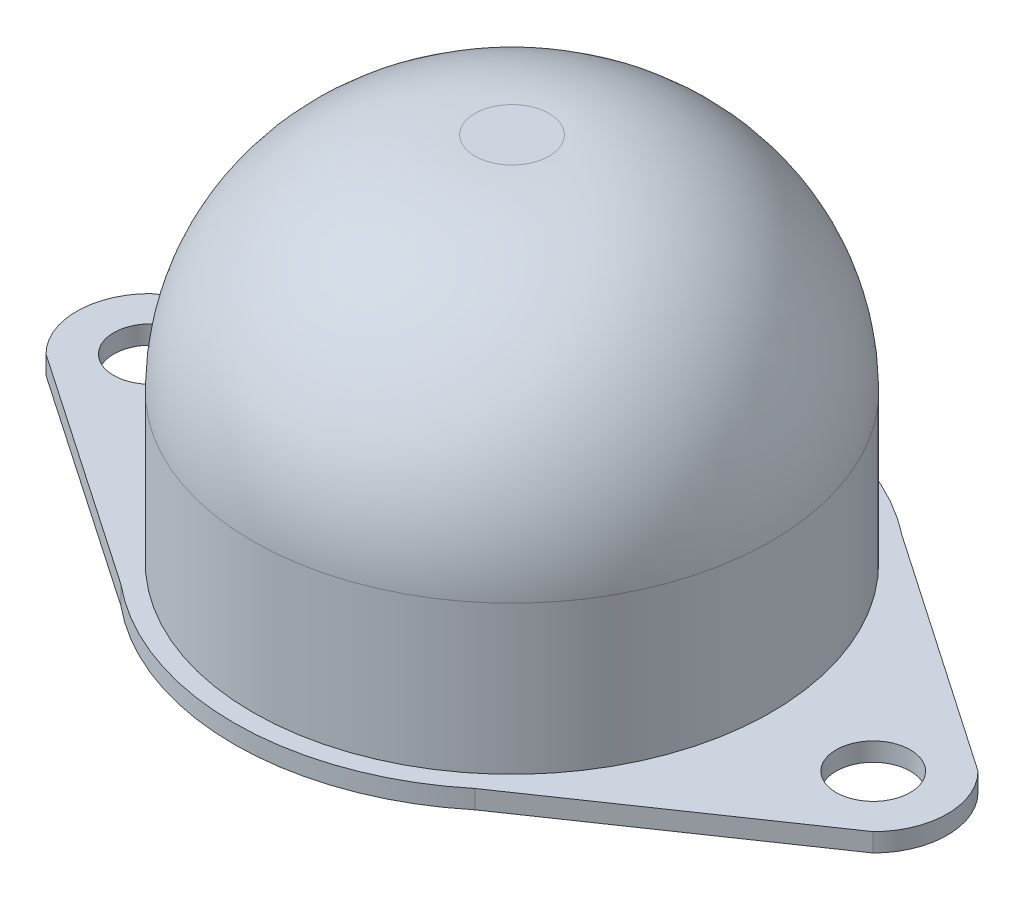
ISO-10303-21;
HEADER;
FILE_DESCRIPTION(('STEP AP214'),'2;1');
FILE_NAME('part.step','',(''),(''),'','','');
FILE_SCHEMA(('AUTOMOTIVE_DESIGN { 1 0 10303 214 1 1 1 1 }'));
ENDSEC;
DATA;
#1=APPLICATION_CONTEXT('core data for automotive mechanical design processes');
#2=APPLICATION_PROTOCOL_DEFINITION('international standard','automotive_design',2000,#1);
#3=PRODUCT_CONTEXT('',#1,'mechanical');
#4=PRODUCT('Part','Part','',(#3));
#5=PRODUCT_RELATED_PRODUCT_CATEGORY('part','',(#4));
#6=PRODUCT_DEFINITION_FORMATION('','',#4);
#7=PRODUCT_DEFINITION_CONTEXT('part definition',#1,'design');
#8=PRODUCT_DEFINITION('design','',#6,#7);
#9=PRODUCT_DEFINITION_SHAPE('','',#8);
#10=(LENGTH_UNIT() NAMED_UNIT(*) SI_UNIT(.MILLI.,.METRE.));
#11=(NAMED_UNIT(*) PLANE_ANGLE_UNIT() SI_UNIT($,.RADIAN.));
#12=(NAMED_UNIT(*) SI_UNIT($,.STERADIAN.) SOLID_ANGLE_UNIT());
#13=UNCERTAINTY_MEASURE_WITH_UNIT(LENGTH_MEASURE(1.E-05),#10,'distance_accuracy_value','');
#14=(GEOMETRIC_REPRESENTATION_CONTEXT(3) GLOBAL_UNCERTAINTY_ASSIGNED_CONTEXT((#13)) GLOBAL_UNIT_ASSIGNED_CONTEXT((#10,
#11,#12)) REPRESENTATION_CONTEXT('',''));
#15=CARTESIAN_POINT('',(0.,0.,0.));
#16=DIRECTION('',(0.,0.,1.));
#17=DIRECTION('',(1.,0.,0.));
#18=AXIS2_PLACEMENT_3D('',#15,#16,#17);
#19=CARTESIAN_POINT('',(0.,-1.,0.));
#20=DIRECTION('',(0.,1.,0.));
#21=DIRECTION('',(0.,0.,1.));
#22=AXIS2_PLACEMENT_3D('',#19,#20,#21);
#23=CYLINDRICAL_SURFACE('',#22,15.);
#24=DIRECTION('',(0.,1.,0.));
#25=VECTOR('',#24,1.);
#26=CARTESIAN_POINT('',(9.55682376628912,-1.,11.5614497144645));
#27=LINE('',#26,#25);
#28=CARTESIAN_POINT('',(9.55682376628912,-1.,11.5614497144645));
#29=VERTEX_POINT('',#28);
#30=CARTESIAN_POINT('',(9.55682376628912,0.,11.5614497144645));
#31=VERTEX_POINT('',#30);
#32=EDGE_CURVE('E141',#29,#31,#27,.T.);
#33=ORIENTED_EDGE('',*,*,#32,.T.);
#34=CARTESIAN_POINT('',(0.,0.,0.));
#35=DIRECTION('',(0.,-1.,0.));
#36=DIRECTION('',(0.,0.,-1.));
#37=AXIS2_PLACEMENT_3D('',#34,#35,#36);
#38=CIRCLE('',#37,15.);
#39=CARTESIAN_POINT('',(-9.55682376628912,0.,11.5614497144645));
#40=VERTEX_POINT('',#39);
#41=EDGE_CURVE('E170',#31,#40,#38,.T.);
#42=ORIENTED_EDGE('',*,*,#41,.T.);
#43=DIRECTION('',(0.,1.,0.));
#44=VECTOR('',#43,1.);
#45=CARTESIAN_POINT('',(-9.55682376628912,-1.,11.5614497144645));
#46=LINE('',#45,#44);
#47=CARTESIAN_POINT('',(-9.55682376628912,-1.,11.5614497144645));
#48=VERTEX_POINT('',#47);
#49=EDGE_CURVE('E174',#48,#40,#46,.T.);
#50=ORIENTED_EDGE('',*,*,#49,.F.);
#51=CARTESIAN_POINT('',(0.,-1.,0.));
#52=DIRECTION('',(0.,-1.,0.));
#53=DIRECTION('',(0.,0.,-1.));
#54=AXIS2_PLACEMENT_3D('',#51,#52,#53);
#55=CIRCLE('',#54,15.);
#56=EDGE_CURVE('E49',#29,#48,#55,.T.);
#57=ORIENTED_EDGE('',*,*,#56,.F.);
#58=EDGE_LOOP('',(#33,#42,#50,#57));
#59=FACE_BOUND('',#58,.T.);
#60=ADVANCED_FACE('F34',(#59),#23,.T.);
#61=CARTESIAN_POINT('',(-9.30029768144452,0.,-11.7687919106643));
#62=VERTEX_POINT('',#61);
#63=CARTESIAN_POINT('',(9.30029768144447,0.,-11.7687919106643));
#64=VERTEX_POINT('',#63);
#65=EDGE_CURVE('E180',#62,#64,#38,.T.);
#66=ORIENTED_EDGE('',*,*,#65,.T.);
#67=DIRECTION('',(0.,1.,0.));
#68=VECTOR('',#67,1.);
#69=CARTESIAN_POINT('',(9.30029768144452,-1.,-11.7687919106643));
#70=LINE('',#69,#68);
#71=CARTESIAN_POINT('',(9.30029768144447,-1.,-11.7687919106643));
#72=VERTEX_POINT('',#71);
#73=EDGE_CURVE('E57',#72,#64,#70,.T.);
#74=ORIENTED_EDGE('',*,*,#73,.F.);
#75=CARTESIAN_POINT('',(-9.30029768144451,-1.,-11.7687919106643));
#76=VERTEX_POINT('',#75);
#77=EDGE_CURVE('E124',#76,#72,#55,.T.);
#78=ORIENTED_EDGE('',*,*,#77,.F.);
#79=DIRECTION('',(0.,1.,0.));
#80=VECTOR('',#79,1.);
#81=CARTESIAN_POINT('',(-9.30029768144452,-1.,-11.7687919106643));
#82=LINE('',#81,#80);
#83=EDGE_CURVE('E171',#76,#62,#82,.T.);
#84=ORIENTED_EDGE('',*,*,#83,.T.);
#85=EDGE_LOOP('',(#66,#74,#78,#84));
#86=FACE_BOUND('',#85,.T.);
#87=ADVANCED_FACE('F200',(#86),#23,.T.);
#88=CARTESIAN_POINT('',(0.,20.,0.));
#89=DIRECTION('',(0.,-1.,0.));
#90=DIRECTION('',(0.,0.,-1.));
#91=AXIS2_PLACEMENT_3D('',#88,#89,#90);
#92=CYLINDRICAL_SURFACE('',#91,14.);
#93=CARTESIAN_POINT('',(0.,8.,0.));
#94=DIRECTION('',(0.,1.,0.));
#95=DIRECTION('',(0.,0.,1.));
#96=AXIS2_PLACEMENT_3D('',#93,#94,#95);
#97=CIRCLE('',#96,14.);
#98=CARTESIAN_POINT('',(0.,8.,14.));
#99=VERTEX_POINT('',#98);
#100=EDGE_CURVE('E11',#99,#99,#97,.F.);
#101=ORIENTED_EDGE('',*,*,#100,.T.);
#102=EDGE_LOOP('',(#101));
#103=FACE_BOUND('',#102,.T.);
#104=CARTESIAN_POINT('',(0.,0.,0.));
#105=DIRECTION('',(0.,1.,0.));
#106=DIRECTION('',(0.,0.,1.));
#107=AXIS2_PLACEMENT_3D('',#104,#105,#106);
#108=CIRCLE('',#107,14.);
#109=CARTESIAN_POINT('',(0.,0.,14.));
#110=VERTEX_POINT('',#109);
#111=EDGE_CURVE('E179',#110,#110,#108,.T.);
#112=ORIENTED_EDGE('',*,*,#111,.T.);
#113=EDGE_LOOP('',(#112));
#114=FACE_BOUND('',#113,.T.);
#115=ADVANCED_FACE('F196',(#103,#114),#92,.T.);
#116=CARTESIAN_POINT('',(0.,20.,0.));
#117=DIRECTION('',(0.,1.,0.));
#118=DIRECTION('',(0.,0.,1.));
#119=AXIS2_PLACEMENT_3D('',#116,#117,#118);
#120=PLANE('',#119);
#121=CARTESIAN_POINT('',(0.,20.,0.));
#122=DIRECTION('',(0.,1.,0.));
#123=DIRECTION('',(0.,0.,1.));
#124=AXIS2_PLACEMENT_3D('',#121,#122,#123);
#125=CIRCLE('',#124,2.);
#126=CARTESIAN_POINT('',(0.,20.,2.));
#127=VERTEX_POINT('',#126);
#128=EDGE_CURVE('E42',#127,#127,#125,.T.);
#129=ORIENTED_EDGE('',*,*,#128,.T.);
#130=EDGE_LOOP('',(#129));
#131=FACE_BOUND('',#130,.T.);
#132=ADVANCED_FACE('F186',(#131),#120,.T.);
#133=CARTESIAN_POINT('',(0.,8.,0.));
#134=DIRECTION('',(0.,1.,0.));
#135=DIRECTION('',(0.,0.,1.));
#136=AXIS2_PLACEMENT_3D('',#133,#134,#135);
#137=DEGENERATE_TOROIDAL_SURFACE('',#136,2.,12.,.T.);
#138=ORIENTED_EDGE('',*,*,#100,.F.);
#139=EDGE_LOOP('',(#138));
#140=FACE_BOUND('',#139,.T.);
#141=ORIENTED_EDGE('',*,*,#128,.F.);
#142=EDGE_LOOP('',(#141));
#143=FACE_BOUND('',#142,.T.);
#144=ADVANCED_FACE('F36',(#140,#143),#137,.T.);
#145=CARTESIAN_POINT('',(0.,-1.,0.));
#146=DIRECTION('',(0.,-1.,0.));
#147=DIRECTION('',(0.,0.,-1.));
#148=AXIS2_PLACEMENT_3D('',#145,#146,#147);
#149=PLANE('',#148);
#150=ORIENTED_EDGE('',*,*,#77,.T.);
#151=DIRECTION('',(-0.824528362654497,0.,-0.56582062456073));
#152=VECTOR('',#151,1.);
#153=CARTESIAN_POINT('',(8.46807314609988,-1.,-12.3398939220584));
#154=LINE('',#153,#152);
#155=CARTESIAN_POINT('',(22.3284271247462,-1.,-2.82842712474619));
#156=VERTEX_POINT('',#155);
#157=EDGE_CURVE('E104',#156,#72,#154,.T.);
#158=ORIENTED_EDGE('',*,*,#157,.F.);
#159=CARTESIAN_POINT('',(19.5,-1.,0.));
#160=DIRECTION('',(0.,1.,0.));
#161=DIRECTION('',(0.,0.,1.));
#162=AXIS2_PLACEMENT_3D('',#159,#160,#161);
#163=CIRCLE('',#162,4.);
#164=CARTESIAN_POINT('',(22.3284271247462,-1.,2.82842712474619));
#165=VERTEX_POINT('',#164);
#166=EDGE_CURVE('E114',#156,#165,#163,.F.);
#167=ORIENTED_EDGE('',*,*,#166,.T.);
#168=DIRECTION('',(-0.825471174124889,0.,0.564444275982029));
#169=VECTOR('',#168,1.);
#170=CARTESIAN_POINT('',(8.43163356624399,-1.,12.3308371718519));
#171=LINE('',#170,#169);
#172=EDGE_CURVE('E125',#165,#29,#171,.T.);
#173=ORIENTED_EDGE('',*,*,#172,.T.);
#174=ORIENTED_EDGE('',*,*,#56,.T.);
#175=DIRECTION('',(0.825471174124889,0.,0.564444275982029));
#176=VECTOR('',#175,1.);
#177=CARTESIAN_POINT('',(-8.43163356624399,-1.,12.3308371718519));
#178=LINE('',#177,#176);
#179=CARTESIAN_POINT('',(-22.3284271247462,-1.,2.82842712474619));
#180=VERTEX_POINT('',#179);
#181=EDGE_CURVE('E147',#180,#48,#178,.T.);
#182=ORIENTED_EDGE('',*,*,#181,.F.);
#183=CARTESIAN_POINT('',(-19.5,-1.,0.));
#184=DIRECTION('',(0.,1.,0.));
#185=DIRECTION('',(0.,0.,1.));
#186=AXIS2_PLACEMENT_3D('',#183,#184,#185);
#187=CIRCLE('',#186,4.);
#188=CARTESIAN_POINT('',(-22.3284271247462,-1.,-2.82842712474619));
#189=VERTEX_POINT('',#188);
#190=EDGE_CURVE('E144',#180,#189,#187,.F.);
#191=ORIENTED_EDGE('',*,*,#190,.T.);
#192=DIRECTION('',(0.824528362654497,0.,-0.56582062456073));
#193=VECTOR('',#192,1.);
#194=CARTESIAN_POINT('',(-8.46807314609988,-1.,-12.3398939220584));
#195=LINE('',#194,#193);
#196=EDGE_CURVE('E151',#189,#76,#195,.T.);
#197=ORIENTED_EDGE('',*,*,#196,.T.);
#198=EDGE_LOOP('',(#150,#158,#167,#173,#174,#182,#191,#197));
#199=FACE_BOUND('',#198,.T.);
#200=CARTESIAN_POINT('',(-19.5,-1.,0.));
#201=DIRECTION('',(0.,1.,0.));
#202=DIRECTION('',(0.,0.,1.));
#203=AXIS2_PLACEMENT_3D('',#200,#201,#202);
#204=CIRCLE('',#203,2.);
#205=CARTESIAN_POINT('',(-19.5,-1.,2.));
#206=VERTEX_POINT('',#205);
#207=EDGE_CURVE('E153',#206,#206,#204,.T.);
#208=ORIENTED_EDGE('',*,*,#207,.T.);
#209=EDGE_LOOP('',(#208));
#210=FACE_BOUND('',#209,.T.);
#211=CARTESIAN_POINT('',(19.5,-1.,0.));
#212=DIRECTION('',(0.,1.,0.));
#213=DIRECTION('',(0.,0.,1.));
#214=AXIS2_PLACEMENT_3D('',#211,#212,#213);
#215=CIRCLE('',#214,2.);
#216=CARTESIAN_POINT('',(19.5,-1.,2.));
#217=VERTEX_POINT('',#216);
#218=EDGE_CURVE('E110',#217,#217,#215,.F.);
#219=ORIENTED_EDGE('',*,*,#218,.F.);
#220=EDGE_LOOP('',(#219));
#221=FACE_BOUND('',#220,.T.);
#222=ADVANCED_FACE('F121',(#199,#210,#221),#149,.T.);
#223=CARTESIAN_POINT('',(0.,0.,0.));
#224=DIRECTION('',(0.,-1.,0.));
#225=DIRECTION('',(0.,0.,-1.));
#226=AXIS2_PLACEMENT_3D('',#223,#224,#225);
#227=PLANE('',#226);
#228=ORIENTED_EDGE('',*,*,#111,.F.);
#229=EDGE_LOOP('',(#228));
#230=FACE_BOUND('',#229,.T.);
#231=ORIENTED_EDGE('',*,*,#65,.F.);
#232=DIRECTION('',(0.824528362654497,0.,-0.56582062456073));
#233=VECTOR('',#232,1.);
#234=CARTESIAN_POINT('',(-8.46807314609988,0.,-12.3398939220584));
#235=LINE('',#234,#233);
#236=CARTESIAN_POINT('',(-22.3284271247462,0.,-2.82842712474619));
#237=VERTEX_POINT('',#236);
#238=EDGE_CURVE('E162',#237,#62,#235,.T.);
#239=ORIENTED_EDGE('',*,*,#238,.F.);
#240=CARTESIAN_POINT('',(-19.5,0.,0.));
#241=DIRECTION('',(0.,1.,0.));
#242=DIRECTION('',(0.,0.,1.));
#243=AXIS2_PLACEMENT_3D('',#240,#241,#242);
#244=CIRCLE('',#243,4.);
#245=CARTESIAN_POINT('',(-22.3284271247462,0.,2.82842712474619));
#246=VERTEX_POINT('',#245);
#247=EDGE_CURVE('E140',#246,#237,#244,.F.);
#248=ORIENTED_EDGE('',*,*,#247,.F.);
#249=DIRECTION('',(0.825471174124889,0.,0.564444275982029));
#250=VECTOR('',#249,1.);
#251=CARTESIAN_POINT('',(-8.43163356624399,0.,12.3308371718519));
#252=LINE('',#251,#250);
#253=EDGE_CURVE('E159',#246,#40,#252,.T.);
#254=ORIENTED_EDGE('',*,*,#253,.T.);
#255=ORIENTED_EDGE('',*,*,#41,.F.);
#256=DIRECTION('',(-0.825471174124889,0.,0.564444275982029));
#257=VECTOR('',#256,1.);
#258=CARTESIAN_POINT('',(8.43163356624399,0.,12.3308371718519));
#259=LINE('',#258,#257);
#260=CARTESIAN_POINT('',(22.3284271247462,0.,2.82842712474619));
#261=VERTEX_POINT('',#260);
#262=EDGE_CURVE('E134',#261,#31,#259,.T.);
#263=ORIENTED_EDGE('',*,*,#262,.F.);
#264=CARTESIAN_POINT('',(19.5,0.,0.));
#265=DIRECTION('',(0.,1.,0.));
#266=DIRECTION('',(0.,0.,1.));
#267=AXIS2_PLACEMENT_3D('',#264,#265,#266);
#268=CIRCLE('',#267,4.);
#269=CARTESIAN_POINT('',(22.3284271247462,0.,-2.82842712474619));
#270=VERTEX_POINT('',#269);
#271=EDGE_CURVE('E131',#270,#261,#268,.F.);
#272=ORIENTED_EDGE('',*,*,#271,.F.);
#273=DIRECTION('',(-0.824528362654497,0.,-0.56582062456073));
#274=VECTOR('',#273,1.);
#275=CARTESIAN_POINT('',(8.46807314609988,0.,-12.3398939220584));
#276=LINE('',#275,#274);
#277=EDGE_CURVE('E106',#270,#64,#276,.T.);
#278=ORIENTED_EDGE('',*,*,#277,.T.);
#279=EDGE_LOOP('',(#231,#239,#248,#254,#255,#263,#272,#278));
#280=FACE_BOUND('',#279,.T.);
#281=CARTESIAN_POINT('',(-19.5,0.,0.));
#282=DIRECTION('',(0.,1.,0.));
#283=DIRECTION('',(0.,0.,1.));
#284=AXIS2_PLACEMENT_3D('',#281,#282,#283);
#285=CIRCLE('',#284,2.);
#286=CARTESIAN_POINT('',(-19.5,0.,2.));
#287=VERTEX_POINT('',#286);
#288=EDGE_CURVE('E148',#287,#287,#285,.T.);
#289=ORIENTED_EDGE('',*,*,#288,.F.);
#290=EDGE_LOOP('',(#289));
#291=FACE_BOUND('',#290,.T.);
#292=CARTESIAN_POINT('',(19.5,0.,0.));
#293=DIRECTION('',(0.,1.,0.));
#294=DIRECTION('',(0.,0.,1.));
#295=AXIS2_PLACEMENT_3D('',#292,#293,#294);
#296=CIRCLE('',#295,2.);
#297=CARTESIAN_POINT('',(19.5,0.,2.));
#298=VERTEX_POINT('',#297);
#299=EDGE_CURVE('E119',#298,#298,#296,.F.);
#300=ORIENTED_EDGE('',*,*,#299,.T.);
#301=EDGE_LOOP('',(#300));
#302=FACE_BOUND('',#301,.T.);
#303=ADVANCED_FACE('F194',(#230,#280,#291,#302),#227,.F.);
#304=CARTESIAN_POINT('',(-19.5,-1.,0.));
#305=DIRECTION('',(0.,1.,0.));
#306=DIRECTION('',(0.,0.,1.));
#307=AXIS2_PLACEMENT_3D('',#304,#305,#306);
#308=CYLINDRICAL_SURFACE('',#307,4.);
#309=ORIENTED_EDGE('',*,*,#247,.T.);
#310=DIRECTION('',(0.,1.,0.));
#311=VECTOR('',#310,1.);
#312=CARTESIAN_POINT('',(-22.3284271247462,-1.,-2.82842712474619));
#313=LINE('',#312,#311);
#314=EDGE_CURVE('E167',#189,#237,#313,.T.);
#315=ORIENTED_EDGE('',*,*,#314,.F.);
#316=ORIENTED_EDGE('',*,*,#190,.F.);
#317=DIRECTION('',(0.,1.,0.));
#318=VECTOR('',#317,1.);
#319=CARTESIAN_POINT('',(-22.3284271247462,-1.,2.82842712474619));
#320=LINE('',#319,#318);
#321=EDGE_CURVE('E156',#180,#246,#320,.T.);
#322=ORIENTED_EDGE('',*,*,#321,.T.);
#323=EDGE_LOOP('',(#309,#315,#316,#322));
#324=FACE_BOUND('',#323,.T.);
#325=ADVANCED_FACE('F215',(#324),#308,.T.);
#326=CARTESIAN_POINT('',(-8.46807314609988,-1.,-12.3398939220584));
#327=DIRECTION('',(0.56582062456073,0.,0.824528362654497));
#328=DIRECTION('',(0.824528362654497,0.,-0.56582062456073));
#329=AXIS2_PLACEMENT_3D('',#326,#327,#328);
#330=PLANE('',#329);
#331=ORIENTED_EDGE('',*,*,#238,.T.);
#332=ORIENTED_EDGE('',*,*,#83,.F.);
#333=ORIENTED_EDGE('',*,*,#196,.F.);
#334=ORIENTED_EDGE('',*,*,#314,.T.);
#335=EDGE_LOOP('',(#331,#332,#333,#334));
#336=FACE_BOUND('',#335,.T.);
#337=ADVANCED_FACE('F241',(#336),#330,.F.);
#338=CARTESIAN_POINT('',(-8.43163356624399,-1.,12.3308371718519));
#339=DIRECTION('',(-0.564444275982029,0.,0.825471174124889));
#340=DIRECTION('',(0.825471174124889,0.,0.564444275982029));
#341=AXIS2_PLACEMENT_3D('',#338,#339,#340);
#342=PLANE('',#341);
#343=ORIENTED_EDGE('',*,*,#253,.F.);
#344=ORIENTED_EDGE('',*,*,#321,.F.);
#345=ORIENTED_EDGE('',*,*,#181,.T.);
#346=ORIENTED_EDGE('',*,*,#49,.T.);
#347=EDGE_LOOP('',(#343,#344,#345,#346));
#348=FACE_BOUND('',#347,.T.);
#349=ADVANCED_FACE('F239',(#348),#342,.T.);
#350=CARTESIAN_POINT('',(-19.5,-1.,0.));
#351=DIRECTION('',(0.,1.,0.));
#352=DIRECTION('',(0.,0.,1.));
#353=AXIS2_PLACEMENT_3D('',#350,#351,#352);
#354=CYLINDRICAL_SURFACE('',#353,2.);
#355=ORIENTED_EDGE('',*,*,#207,.F.);
#356=EDGE_LOOP('',(#355));
#357=FACE_BOUND('',#356,.T.);
#358=ORIENTED_EDGE('',*,*,#288,.T.);
#359=EDGE_LOOP('',(#358));
#360=FACE_BOUND('',#359,.T.);
#361=ADVANCED_FACE('F236',(#357,#360),#354,.F.);
#362=CARTESIAN_POINT('',(19.5,-1.,0.));
#363=DIRECTION('',(0.,1.,0.));
#364=DIRECTION('',(0.,0.,1.));
#365=AXIS2_PLACEMENT_3D('',#362,#363,#364);
#366=CYLINDRICAL_SURFACE('',#365,4.);
#367=ORIENTED_EDGE('',*,*,#271,.T.);
#368=DIRECTION('',(0.,1.,0.));
#369=VECTOR('',#368,1.);
#370=CARTESIAN_POINT('',(22.3284271247462,-1.,2.82842712474619));
#371=LINE('',#370,#369);
#372=EDGE_CURVE('E117',#165,#261,#371,.T.);
#373=ORIENTED_EDGE('',*,*,#372,.F.);
#374=ORIENTED_EDGE('',*,*,#166,.F.);
#375=DIRECTION('',(0.,1.,0.));
#376=VECTOR('',#375,1.);
#377=CARTESIAN_POINT('',(22.3284271247462,-1.,-2.82842712474619));
#378=LINE('',#377,#376);
#379=EDGE_CURVE('E100',#156,#270,#378,.T.);
#380=ORIENTED_EDGE('',*,*,#379,.T.);
#381=EDGE_LOOP('',(#367,#373,#374,#380));
#382=FACE_BOUND('',#381,.T.);
#383=ADVANCED_FACE('F115',(#382),#366,.T.);
#384=CARTESIAN_POINT('',(8.43163356624399,-1.,12.3308371718519));
#385=DIRECTION('',(-0.564444275982029,0.,-0.825471174124889));
#386=DIRECTION('',(-0.825471174124889,0.,0.564444275982029));
#387=AXIS2_PLACEMENT_3D('',#384,#385,#386);
#388=PLANE('',#387);
#389=ORIENTED_EDGE('',*,*,#262,.T.);
#390=ORIENTED_EDGE('',*,*,#32,.F.);
#391=ORIENTED_EDGE('',*,*,#172,.F.);
#392=ORIENTED_EDGE('',*,*,#372,.T.);
#393=EDGE_LOOP('',(#389,#390,#391,#392));
#394=FACE_BOUND('',#393,.T.);
#395=ADVANCED_FACE('F228',(#394),#388,.F.);
#396=CARTESIAN_POINT('',(8.46807314609988,-1.,-12.3398939220584));
#397=DIRECTION('',(0.56582062456073,0.,-0.824528362654497));
#398=DIRECTION('',(-0.824528362654497,0.,-0.56582062456073));
#399=AXIS2_PLACEMENT_3D('',#396,#397,#398);
#400=PLANE('',#399);
#401=ORIENTED_EDGE('',*,*,#277,.F.);
#402=ORIENTED_EDGE('',*,*,#379,.F.);
#403=ORIENTED_EDGE('',*,*,#157,.T.);
#404=ORIENTED_EDGE('',*,*,#73,.T.);
#405=EDGE_LOOP('',(#401,#402,#403,#404));
#406=FACE_BOUND('',#405,.T.);
#407=ADVANCED_FACE('F102',(#406),#400,.T.);
#408=CARTESIAN_POINT('',(19.5,-1.,0.));
#409=DIRECTION('',(0.,1.,0.));
#410=DIRECTION('',(0.,0.,1.));
#411=AXIS2_PLACEMENT_3D('',#408,#409,#410);
#412=CYLINDRICAL_SURFACE('',#411,2.);
#413=ORIENTED_EDGE('',*,*,#218,.T.);
#414=EDGE_LOOP('',(#413));
#415=FACE_BOUND('',#414,.T.);
#416=ORIENTED_EDGE('',*,*,#299,.F.);
#417=EDGE_LOOP('',(#416));
#418=FACE_BOUND('',#417,.T.);
#419=ADVANCED_FACE('F221',(#415,#418),#412,.F.);
#420=CLOSED_SHELL('',(#60,#87,#115,#132,#144,#222,#303,#325,#337,#349,#361,#383,#395,#407,#419));
#421=MANIFOLD_SOLID_BREP('B2',#420);
#422=ADVANCED_BREP_SHAPE_REPRESENTATION('',(#18,#421),#14);
#423=SHAPE_DEFINITION_REPRESENTATION(#9,#422);
ENDSEC;
END-ISO-10303-21;
